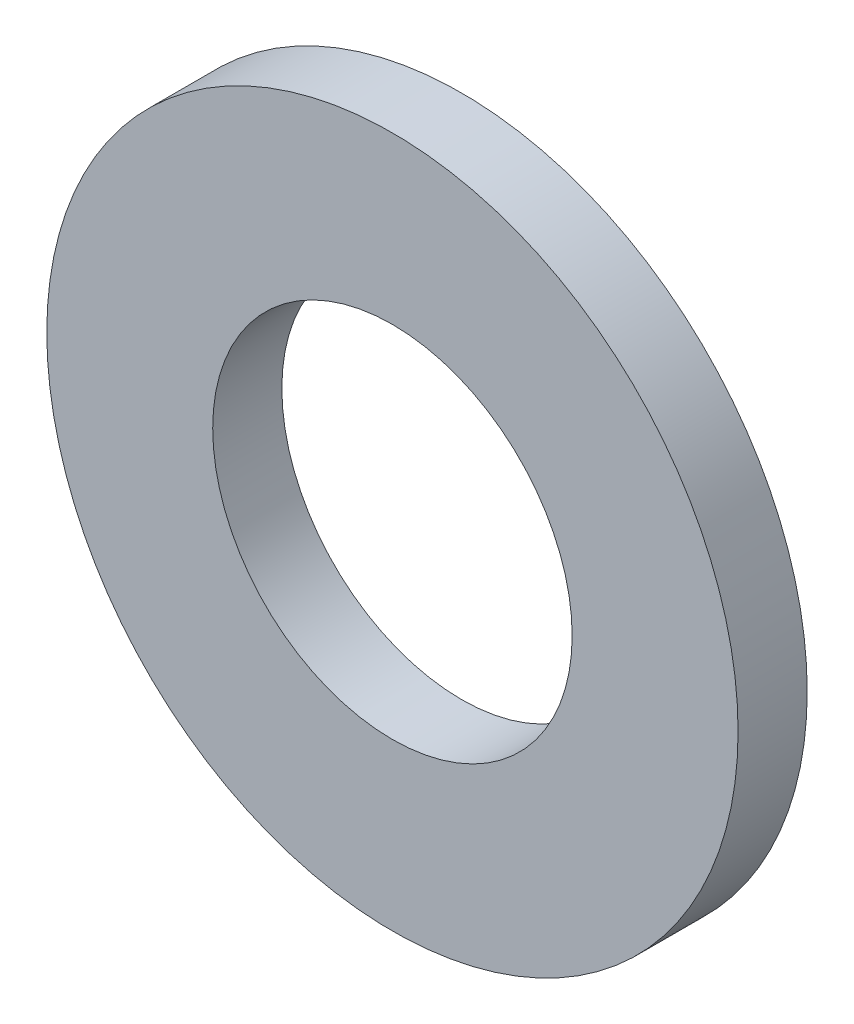
ISO-10303-21;
HEADER;
FILE_DESCRIPTION(('STEP AP214'),'2;1');
FILE_NAME('part.step','',(''),(''),'','','');
FILE_SCHEMA(('AUTOMOTIVE_DESIGN { 1 0 10303 214 1 1 1 1 }'));
ENDSEC;
DATA;
#1=APPLICATION_CONTEXT('core data for automotive mechanical design processes');
#2=APPLICATION_PROTOCOL_DEFINITION('international standard','automotive_design',2000,#1);
#3=PRODUCT_CONTEXT('',#1,'mechanical');
#4=PRODUCT('Part','Part','',(#3));
#5=PRODUCT_RELATED_PRODUCT_CATEGORY('part','',(#4));
#6=PRODUCT_DEFINITION_FORMATION('','',#4);
#7=PRODUCT_DEFINITION_CONTEXT('part definition',#1,'design');
#8=PRODUCT_DEFINITION('design','',#6,#7);
#9=PRODUCT_DEFINITION_SHAPE('','',#8);
#10=(LENGTH_UNIT() NAMED_UNIT(*) SI_UNIT(.MILLI.,.METRE.));
#11=(NAMED_UNIT(*) PLANE_ANGLE_UNIT() SI_UNIT($,.RADIAN.));
#12=(NAMED_UNIT(*) SI_UNIT($,.STERADIAN.) SOLID_ANGLE_UNIT());
#13=UNCERTAINTY_MEASURE_WITH_UNIT(LENGTH_MEASURE(1.E-05),#10,'distance_accuracy_value','');
#14=(GEOMETRIC_REPRESENTATION_CONTEXT(3) GLOBAL_UNCERTAINTY_ASSIGNED_CONTEXT((#13)) GLOBAL_UNIT_ASSIGNED_CONTEXT((#10,
#11,#12)) REPRESENTATION_CONTEXT('',''));
#15=CARTESIAN_POINT('',(0.,0.,0.));
#16=DIRECTION('',(0.,0.,1.));
#17=DIRECTION('',(1.,0.,0.));
#18=AXIS2_PLACEMENT_3D('',#15,#16,#17);
#19=CARTESIAN_POINT('',(-1.90802493216324,2.49134831022957,-1.08291849705938));
#20=DIRECTION('',(0.,0.,1.));
#21=DIRECTION('',(-1.,0.,0.));
#22=AXIS2_PLACEMENT_3D('',#19,#20,#21);
#23=CYLINDRICAL_SURFACE('',#22,2.6);
#24=CARTESIAN_POINT('',(-1.90802493216324,2.49134831022957,-1.08291849705938));
#25=DIRECTION('',(0.,0.,1.));
#26=DIRECTION('',(-1.,0.,0.));
#27=AXIS2_PLACEMENT_3D('',#24,#25,#26);
#28=CIRCLE('',#27,2.6);
#29=CARTESIAN_POINT('',(0.691975067836756,2.49134831022957,-1.08291849705938));
#30=VERTEX_POINT('',#29);
#31=EDGE_CURVE('E38',#30,#30,#28,.T.);
#32=ORIENTED_EDGE('',*,*,#31,.F.);
#33=DIRECTION('',(0.,0.,1.));
#34=VECTOR('',#33,1.);
#35=CARTESIAN_POINT('',(0.691975067836756,2.49134831022957,-1.08291849705938));
#36=LINE('',#35,#34);
#37=CARTESIAN_POINT('',(0.691975067836756,2.49134831022957,-0.0829184970593815));
#38=VERTEX_POINT('',#37);
#39=EDGE_CURVE('E10',#30,#38,#36,.T.);
#40=ORIENTED_EDGE('',*,*,#39,.T.);
#41=CARTESIAN_POINT('',(-1.90802493216324,2.49134831022957,-0.0829184970593815));
#42=DIRECTION('',(0.,0.,-1.));
#43=DIRECTION('',(-1.,0.,0.));
#44=AXIS2_PLACEMENT_3D('',#41,#42,#43);
#45=CIRCLE('',#44,2.6);
#46=EDGE_CURVE('E68',#38,#38,#45,.T.);
#47=ORIENTED_EDGE('',*,*,#46,.F.);
#48=ORIENTED_EDGE('',*,*,#39,.F.);
#49=EDGE_LOOP('',(#32,#40,#47,#48));
#50=FACE_BOUND('',#49,.T.);
#51=ADVANCED_FACE('F16',(#50),#23,.F.);
#52=CARTESIAN_POINT('',(-1.90802493216324,2.49134831022957,-1.08291849705938));
#53=DIRECTION('',(0.,0.,1.));
#54=DIRECTION('',(-1.,0.,0.));
#55=AXIS2_PLACEMENT_3D('',#52,#53,#54);
#56=CYLINDRICAL_SURFACE('',#55,5.);
#57=CARTESIAN_POINT('',(-1.90802493216324,2.49134831022957,-0.0829184970593815));
#58=DIRECTION('',(0.,0.,1.));
#59=DIRECTION('',(-1.,0.,0.));
#60=AXIS2_PLACEMENT_3D('',#57,#58,#59);
#61=CIRCLE('',#60,5.);
#62=CARTESIAN_POINT('',(3.09197506783676,2.49134831022957,-0.0829184970593815));
#63=VERTEX_POINT('',#62);
#64=EDGE_CURVE('E51',#63,#63,#61,.T.);
#65=ORIENTED_EDGE('',*,*,#64,.F.);
#66=DIRECTION('',(0.,0.,-1.));
#67=VECTOR('',#66,1.);
#68=CARTESIAN_POINT('',(3.09197506783676,2.49134831022957,-1.08291849705938));
#69=LINE('',#68,#67);
#70=CARTESIAN_POINT('',(3.09197506783676,2.49134831022957,-1.08291849705938));
#71=VERTEX_POINT('',#70);
#72=EDGE_CURVE('E20',#63,#71,#69,.T.);
#73=ORIENTED_EDGE('',*,*,#72,.T.);
#74=CARTESIAN_POINT('',(-1.90802493216324,2.49134831022957,-1.08291849705938));
#75=DIRECTION('',(0.,0.,-1.));
#76=DIRECTION('',(-1.,0.,0.));
#77=AXIS2_PLACEMENT_3D('',#74,#75,#76);
#78=CIRCLE('',#77,5.);
#79=EDGE_CURVE('E56',#71,#71,#78,.T.);
#80=ORIENTED_EDGE('',*,*,#79,.F.);
#81=ORIENTED_EDGE('',*,*,#72,.F.);
#82=EDGE_LOOP('',(#65,#73,#80,#81));
#83=FACE_BOUND('',#82,.T.);
#84=ADVANCED_FACE('F57',(#83),#56,.T.);
#85=CARTESIAN_POINT('',(-1.90802493216324,2.49134831022957,-1.08291849705938));
#86=DIRECTION('',(0.,0.,1.));
#87=DIRECTION('',(1.,0.,0.));
#88=AXIS2_PLACEMENT_3D('',#85,#86,#87);
#89=PLANE('',#88);
#90=ORIENTED_EDGE('',*,*,#79,.T.);
#91=EDGE_LOOP('',(#90));
#92=FACE_BOUND('',#91,.T.);
#93=ORIENTED_EDGE('',*,*,#31,.T.);
#94=EDGE_LOOP('',(#93));
#95=FACE_BOUND('',#94,.T.);
#96=ADVANCED_FACE('F79',(#92,#95),#89,.F.);
#97=CARTESIAN_POINT('',(-1.90802493216324,2.49134831022957,-0.0829184970593815));
#98=DIRECTION('',(0.,0.,1.));
#99=DIRECTION('',(1.,0.,0.));
#100=AXIS2_PLACEMENT_3D('',#97,#98,#99);
#101=PLANE('',#100);
#102=ORIENTED_EDGE('',*,*,#64,.T.);
#103=EDGE_LOOP('',(#102));
#104=FACE_BOUND('',#103,.T.);
#105=ORIENTED_EDGE('',*,*,#46,.T.);
#106=EDGE_LOOP('',(#105));
#107=FACE_BOUND('',#106,.T.);
#108=ADVANCED_FACE('F18',(#104,#107),#101,.T.);
#109=CLOSED_SHELL('',(#51,#84,#96,#108));
#110=MANIFOLD_SOLID_BREP('B1',#109);
#111=ADVANCED_BREP_SHAPE_REPRESENTATION('',(#18,#110),#14);
#112=SHAPE_DEFINITION_REPRESENTATION(#9,#111);
ENDSEC;
END-ISO-10303-21;
